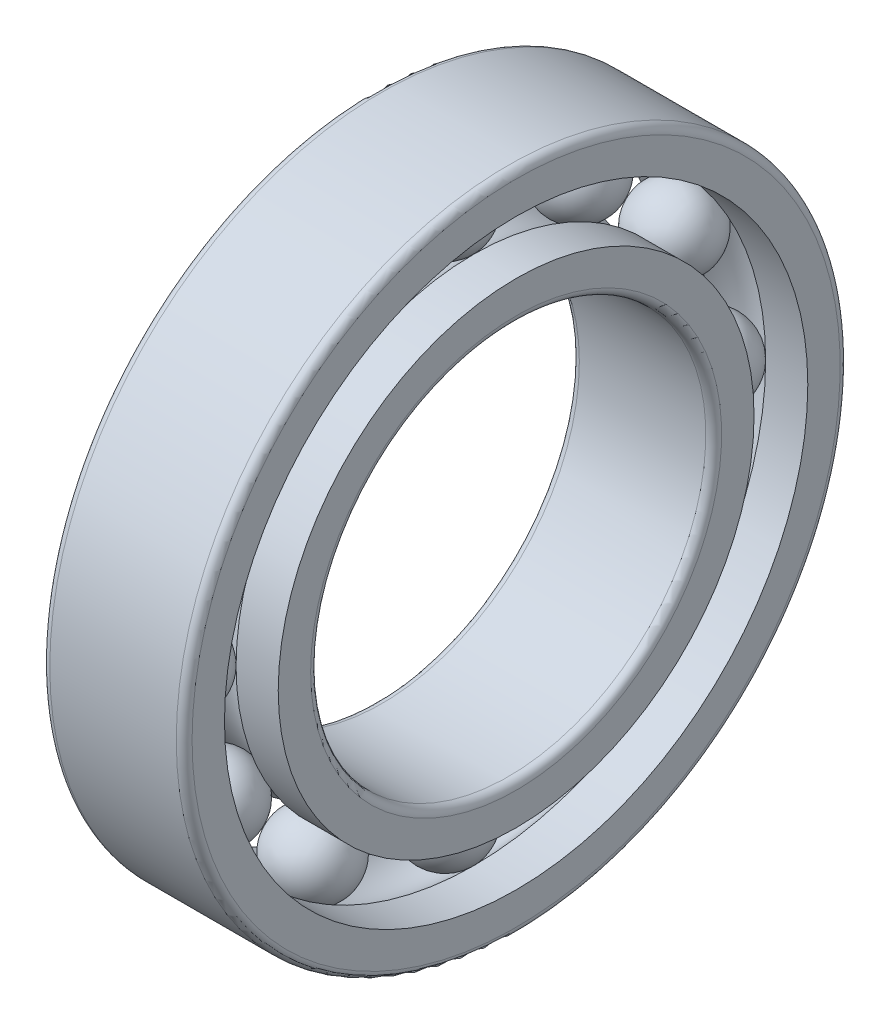
ISO-10303-21;
HEADER;
FILE_DESCRIPTION(('STEP AP214'),'2;1');
FILE_NAME('part.step','',(''),(''),'','','');
FILE_SCHEMA(('AUTOMOTIVE_DESIGN { 1 0 10303 214 1 1 1 1 }'));
ENDSEC;
DATA;
#1=APPLICATION_CONTEXT('core data for automotive mechanical design processes');
#2=APPLICATION_PROTOCOL_DEFINITION('international standard','automotive_design',2000,#1);
#3=PRODUCT_CONTEXT('',#1,'mechanical');
#4=PRODUCT('Part','Part','',(#3));
#5=PRODUCT_RELATED_PRODUCT_CATEGORY('part','',(#4));
#6=PRODUCT_DEFINITION_FORMATION('','',#4);
#7=PRODUCT_DEFINITION_CONTEXT('part definition',#1,'design');
#8=PRODUCT_DEFINITION('design','',#6,#7);
#9=PRODUCT_DEFINITION_SHAPE('','',#8);
#10=(LENGTH_UNIT() NAMED_UNIT(*) SI_UNIT(.MILLI.,.METRE.));
#11=(NAMED_UNIT(*) PLANE_ANGLE_UNIT() SI_UNIT($,.RADIAN.));
#12=(NAMED_UNIT(*) SI_UNIT($,.STERADIAN.) SOLID_ANGLE_UNIT());
#13=UNCERTAINTY_MEASURE_WITH_UNIT(LENGTH_MEASURE(1.E-05),#10,'distance_accuracy_value','');
#14=(GEOMETRIC_REPRESENTATION_CONTEXT(3) GLOBAL_UNCERTAINTY_ASSIGNED_CONTEXT((#13)) GLOBAL_UNIT_ASSIGNED_CONTEXT((#10,
#11,#12)) REPRESENTATION_CONTEXT('',''));
#15=CARTESIAN_POINT('',(0.,0.,0.));
#16=DIRECTION('',(0.,0.,1.));
#17=DIRECTION('',(1.,0.,0.));
#18=AXIS2_PLACEMENT_3D('',#15,#16,#17);
#19=CARTESIAN_POINT('',(4.50000000000001,14.5059255133895,-8.37499999999983));
#20=DIRECTION('',(-1.,0.,0.));
#21=DIRECTION('',(0.,0.866025403784445,-0.499999999999989));
#22=AXIS2_PLACEMENT_3D('',#19,#20,#21);
#23=SPHERICAL_SURFACE('',#22,2.49999999999999);
#24=CARTESIAN_POINT('',(2.00000000000002,14.5059255133895,-8.37499999999983));
#25=VERTEX_POINT('',#24);
#26=VERTEX_LOOP('',#25);
#27=FACE_BOUND('',#26,.T.);
#28=ADVANCED_FACE('F42',(#27),#23,.T.);
#29=CLOSED_SHELL('',(#28));
#30=MANIFOLD_SOLID_BREP('B2',#29);
#31=CARTESIAN_POINT('',(4.50000000000001,8.37500000000018,-14.5059255133893));
#32=DIRECTION('',(-1.,0.,0.));
#33=DIRECTION('',(0.,0.50000000000001,-0.866025403784433));
#34=AXIS2_PLACEMENT_3D('',#31,#32,#33);
#35=SPHERICAL_SURFACE('',#34,2.49999999999999);
#36=CARTESIAN_POINT('',(2.00000000000002,8.37500000000018,-14.5059255133893));
#37=VERTEX_POINT('',#36);
#38=VERTEX_LOOP('',#37);
#39=FACE_BOUND('',#38,.T.);
#40=ADVANCED_FACE('F63',(#39),#35,.T.);
#41=CLOSED_SHELL('',(#40));
#42=MANIFOLD_SOLID_BREP('B6',#41);
#43=CARTESIAN_POINT('',(4.50000000000001,1.75446937276868E-13,-16.75));
#44=DIRECTION('',(-1.,0.,0.));
#45=DIRECTION('',(0.,0.,-1.));
#46=AXIS2_PLACEMENT_3D('',#43,#44,#45);
#47=SPHERICAL_SURFACE('',#46,2.49999999999999);
#48=CARTESIAN_POINT('',(2.00000000000002,1.75446937276868E-13,-16.75));
#49=VERTEX_POINT('',#48);
#50=VERTEX_LOOP('',#49);
#51=FACE_BOUND('',#50,.T.);
#52=ADVANCED_FACE('F84',(#51),#47,.T.);
#53=CLOSED_SHELL('',(#52));
#54=MANIFOLD_SOLID_BREP('B38',#53);
#55=CARTESIAN_POINT('',(4.50000000000001,-8.37499999999988,-14.5059255133894));
#56=DIRECTION('',(-1.,0.,0.));
#57=DIRECTION('',(0.,-0.499999999999992,-0.866025403784443));
#58=AXIS2_PLACEMENT_3D('',#55,#56,#57);
#59=SPHERICAL_SURFACE('',#58,2.49999999999999);
#60=CARTESIAN_POINT('',(2.00000000000002,-8.37499999999988,-14.5059255133894));
#61=VERTEX_POINT('',#60);
#62=VERTEX_LOOP('',#61);
#63=FACE_BOUND('',#62,.T.);
#64=ADVANCED_FACE('F105',(#63),#59,.T.);
#65=CLOSED_SHELL('',(#64));
#66=MANIFOLD_SOLID_BREP('B59',#65);
#67=CARTESIAN_POINT('',(4.50000000000001,-14.5059255133893,-8.37500000000013));
#68=DIRECTION('',(-1.,0.,0.));
#69=DIRECTION('',(0.,-0.866025403784435,-0.500000000000007));
#70=AXIS2_PLACEMENT_3D('',#67,#68,#69);
#71=SPHERICAL_SURFACE('',#70,2.49999999999999);
#72=CARTESIAN_POINT('',(2.00000000000002,-14.5059255133893,-8.37500000000013));
#73=VERTEX_POINT('',#72);
#74=VERTEX_LOOP('',#73);
#75=FACE_BOUND('',#74,.T.);
#76=ADVANCED_FACE('F126',(#75),#71,.T.);
#77=CLOSED_SHELL('',(#76));
#78=MANIFOLD_SOLID_BREP('B80',#77);
#79=CARTESIAN_POINT('',(4.50000000000001,-16.75,0.));
#80=DIRECTION('',(-1.,0.,0.));
#81=DIRECTION('',(0.,-1.,0.));
#82=AXIS2_PLACEMENT_3D('',#79,#80,#81);
#83=SPHERICAL_SURFACE('',#82,2.49999999999999);
#84=CARTESIAN_POINT('',(2.00000000000002,-16.75,0.));
#85=VERTEX_POINT('',#84);
#86=VERTEX_LOOP('',#85);
#87=FACE_BOUND('',#86,.T.);
#88=ADVANCED_FACE('F147',(#87),#83,.T.);
#89=CLOSED_SHELL('',(#88));
#90=MANIFOLD_SOLID_BREP('B101',#89);
#91=CARTESIAN_POINT('',(4.50000000000001,-14.5059255133894,8.37499999999993));
#92=DIRECTION('',(-1.,0.,0.));
#93=DIRECTION('',(0.,-0.866025403784442,0.499999999999995));
#94=AXIS2_PLACEMENT_3D('',#91,#92,#93);
#95=SPHERICAL_SURFACE('',#94,2.49999999999999);
#96=CARTESIAN_POINT('',(2.00000000000002,-14.5059255133894,8.37499999999993));
#97=VERTEX_POINT('',#96);
#98=VERTEX_LOOP('',#97);
#99=FACE_BOUND('',#98,.T.);
#100=ADVANCED_FACE('F168',(#99),#95,.T.);
#101=CLOSED_SHELL('',(#100));
#102=MANIFOLD_SOLID_BREP('B122',#101);
#103=CARTESIAN_POINT('',(4.50000000000001,-8.37500000000008,14.5059255133893));
#104=DIRECTION('',(-1.,0.,0.));
#105=DIRECTION('',(0.,-0.500000000000004,0.866025403784436));
#106=AXIS2_PLACEMENT_3D('',#103,#104,#105);
#107=SPHERICAL_SURFACE('',#106,2.49999999999999);
#108=CARTESIAN_POINT('',(2.00000000000002,-8.37500000000008,14.5059255133893));
#109=VERTEX_POINT('',#108);
#110=VERTEX_LOOP('',#109);
#111=FACE_BOUND('',#110,.T.);
#112=ADVANCED_FACE('F189',(#111),#107,.T.);
#113=CLOSED_SHELL('',(#112));
#114=MANIFOLD_SOLID_BREP('B143',#113);
#115=CARTESIAN_POINT('',(4.50000000000001,0.,16.75));
#116=DIRECTION('',(-1.,0.,0.));
#117=DIRECTION('',(0.,0.,1.));
#118=AXIS2_PLACEMENT_3D('',#115,#116,#117);
#119=SPHERICAL_SURFACE('',#118,2.49999999999999);
#120=CARTESIAN_POINT('',(2.00000000000002,0.,16.75));
#121=VERTEX_POINT('',#120);
#122=VERTEX_LOOP('',#121);
#123=FACE_BOUND('',#122,.T.);
#124=ADVANCED_FACE('F210',(#123),#119,.T.);
#125=CLOSED_SHELL('',(#124));
#126=MANIFOLD_SOLID_BREP('B164',#125);
#127=CARTESIAN_POINT('',(4.50000000000001,8.37499999999998,14.5059255133894));
#128=DIRECTION('',(-1.,0.,0.));
#129=DIRECTION('',(0.,0.499999999999998,0.86602540378444));
#130=AXIS2_PLACEMENT_3D('',#127,#128,#129);
#131=SPHERICAL_SURFACE('',#130,2.49999999999999);
#132=CARTESIAN_POINT('',(2.00000000000002,8.37499999999998,14.5059255133894));
#133=VERTEX_POINT('',#132);
#134=VERTEX_LOOP('',#133);
#135=FACE_BOUND('',#134,.T.);
#136=ADVANCED_FACE('F231',(#135),#131,.T.);
#137=CLOSED_SHELL('',(#136));
#138=MANIFOLD_SOLID_BREP('B185',#137);
#139=CARTESIAN_POINT('',(4.50000000000001,14.5059255133894,8.37500000000003));
#140=DIRECTION('',(-1.,0.,0.));
#141=DIRECTION('',(0.,0.866025403784438,0.500000000000001));
#142=AXIS2_PLACEMENT_3D('',#139,#140,#141);
#143=SPHERICAL_SURFACE('',#142,2.49999999999999);
#144=CARTESIAN_POINT('',(2.00000000000002,14.5059255133894,8.37500000000003));
#145=VERTEX_POINT('',#144);
#146=VERTEX_LOOP('',#145);
#147=FACE_BOUND('',#146,.T.);
#148=ADVANCED_FACE('F252',(#147),#143,.T.);
#149=CLOSED_SHELL('',(#148));
#150=MANIFOLD_SOLID_BREP('B206',#149);
#151=CARTESIAN_POINT('',(4.50000000000001,16.75,0.));
#152=DIRECTION('',(-1.,0.,0.));
#153=DIRECTION('',(0.,1.,0.));
#154=AXIS2_PLACEMENT_3D('',#151,#152,#153);
#155=SPHERICAL_SURFACE('',#154,2.49999999999999);
#156=CARTESIAN_POINT('',(2.00000000000002,16.75,0.));
#157=VERTEX_POINT('',#156);
#158=VERTEX_LOOP('',#157);
#159=FACE_BOUND('',#158,.T.);
#160=ADVANCED_FACE('F275',(#159),#155,.T.);
#161=CLOSED_SHELL('',(#160));
#162=MANIFOLD_SOLID_BREP('B227',#161);
#163=CARTESIAN_POINT('',(0.,0.,0.));
#164=DIRECTION('',(-1.,0.,0.));
#165=DIRECTION('',(0.,0.,1.));
#166=AXIS2_PLACEMENT_3D('',#163,#164,#165);
#167=CYLINDRICAL_SURFACE('',#166,18.45);
#168=CARTESIAN_POINT('',(2.66696972201768,0.,0.));
#169=DIRECTION('',(-1.,0.,0.));
#170=DIRECTION('',(0.,0.,1.));
#171=AXIS2_PLACEMENT_3D('',#168,#169,#170);
#172=CIRCLE('',#171,18.45);
#173=CARTESIAN_POINT('',(2.66696972201768,0.,18.45));
#174=VERTEX_POINT('',#173);
#175=EDGE_CURVE('E326',#174,#174,#172,.T.);
#176=ORIENTED_EDGE('',*,*,#175,.F.);
#177=EDGE_LOOP('',(#176));
#178=FACE_BOUND('',#177,.T.);
#179=CARTESIAN_POINT('',(0.,0.,0.));
#180=DIRECTION('',(-1.,0.,0.));
#181=DIRECTION('',(0.,0.,1.));
#182=AXIS2_PLACEMENT_3D('',#179,#180,#181);
#183=CIRCLE('',#182,18.45);
#184=CARTESIAN_POINT('',(0.,0.,18.45));
#185=VERTEX_POINT('',#184);
#186=EDGE_CURVE('E317',#185,#185,#183,.T.);
#187=ORIENTED_EDGE('',*,*,#186,.T.);
#188=EDGE_LOOP('',(#187));
#189=FACE_BOUND('',#188,.T.);
#190=ADVANCED_FACE('F297',(#178,#189),#167,.F.);
#191=CARTESIAN_POINT('',(0.,21.0000000000008,0.));
#192=DIRECTION('',(1.,0.,0.));
#193=DIRECTION('',(0.,0.,-1.));
#194=AXIS2_PLACEMENT_3D('',#191,#192,#193);
#195=PLANE('',#194);
#196=CARTESIAN_POINT('',(0.,0.,0.));
#197=DIRECTION('',(1.,0.,0.));
#198=DIRECTION('',(0.,0.,-1.));
#199=AXIS2_PLACEMENT_3D('',#196,#197,#198);
#200=CIRCLE('',#199,20.5000000000004);
#201=CARTESIAN_POINT('',(0.,0.,-20.5000000000004));
#202=VERTEX_POINT('',#201);
#203=EDGE_CURVE('E274',#202,#202,#200,.F.);
#204=ORIENTED_EDGE('',*,*,#203,.T.);
#205=EDGE_LOOP('',(#204));
#206=FACE_BOUND('',#205,.T.);
#207=ORIENTED_EDGE('',*,*,#186,.F.);
#208=EDGE_LOOP('',(#207));
#209=FACE_BOUND('',#208,.T.);
#210=ADVANCED_FACE('F335',(#206,#209),#195,.F.);
#211=CARTESIAN_POINT('',(0.,0.,0.));
#212=DIRECTION('',(-1.,0.,0.));
#213=DIRECTION('',(0.,0.,1.));
#214=AXIS2_PLACEMENT_3D('',#211,#212,#213);
#215=CYLINDRICAL_SURFACE('',#214,21.0000000000004);
#216=CARTESIAN_POINT('',(8.5,0.,0.));
#217=DIRECTION('',(-1.,0.,0.));
#218=DIRECTION('',(0.,0.,1.));
#219=AXIS2_PLACEMENT_3D('',#216,#217,#218);
#220=CIRCLE('',#219,21.0000000000004);
#221=CARTESIAN_POINT('',(8.5,0.,21.0000000000004));
#222=VERTEX_POINT('',#221);
#223=EDGE_CURVE('E308',#222,#222,#220,.T.);
#224=ORIENTED_EDGE('',*,*,#223,.T.);
#225=EDGE_LOOP('',(#224));
#226=FACE_BOUND('',#225,.T.);
#227=CARTESIAN_POINT('',(0.5,0.,0.));
#228=DIRECTION('',(1.,0.,0.));
#229=DIRECTION('',(0.,0.,-1.));
#230=AXIS2_PLACEMENT_3D('',#227,#228,#229);
#231=CIRCLE('',#230,21.0000000000004);
#232=CARTESIAN_POINT('',(0.5,0.,-21.0000000000004));
#233=VERTEX_POINT('',#232);
#234=EDGE_CURVE('E312',#233,#233,#231,.T.);
#235=ORIENTED_EDGE('',*,*,#234,.T.);
#236=EDGE_LOOP('',(#235));
#237=FACE_BOUND('',#236,.T.);
#238=ADVANCED_FACE('F340',(#226,#237),#215,.T.);
#239=CARTESIAN_POINT('',(9.,18.45,0.));
#240=DIRECTION('',(-1.,0.,0.));
#241=DIRECTION('',(0.,0.,1.));
#242=AXIS2_PLACEMENT_3D('',#239,#240,#241);
#243=PLANE('',#242);
#244=CARTESIAN_POINT('',(9.,0.,0.));
#245=DIRECTION('',(-1.,0.,0.));
#246=DIRECTION('',(0.,0.,1.));
#247=AXIS2_PLACEMENT_3D('',#244,#245,#246);
#248=CIRCLE('',#247,20.5000000000004);
#249=CARTESIAN_POINT('',(9.,0.,20.5000000000004));
#250=VERTEX_POINT('',#249);
#251=EDGE_CURVE('E304',#250,#250,#248,.F.);
#252=ORIENTED_EDGE('',*,*,#251,.T.);
#253=EDGE_LOOP('',(#252));
#254=FACE_BOUND('',#253,.T.);
#255=CARTESIAN_POINT('',(9.,0.,0.));
#256=DIRECTION('',(-1.,0.,0.));
#257=DIRECTION('',(0.,0.,1.));
#258=AXIS2_PLACEMENT_3D('',#255,#256,#257);
#259=CIRCLE('',#258,18.45);
#260=CARTESIAN_POINT('',(9.,0.,18.45));
#261=VERTEX_POINT('',#260);
#262=EDGE_CURVE('E320',#261,#261,#259,.T.);
#263=ORIENTED_EDGE('',*,*,#262,.T.);
#264=EDGE_LOOP('',(#263));
#265=FACE_BOUND('',#264,.T.);
#266=ADVANCED_FACE('F345',(#254,#265),#243,.F.);
#267=CARTESIAN_POINT('',(0.,0.,0.));
#268=DIRECTION('',(-1.,0.,0.));
#269=DIRECTION('',(0.,0.,1.));
#270=AXIS2_PLACEMENT_3D('',#267,#268,#269);
#271=CYLINDRICAL_SURFACE('',#270,18.45);
#272=ORIENTED_EDGE('',*,*,#262,.F.);
#273=EDGE_LOOP('',(#272));
#274=FACE_BOUND('',#273,.T.);
#275=CARTESIAN_POINT('',(6.33303027798233,0.,0.));
#276=DIRECTION('',(-1.,0.,0.));
#277=DIRECTION('',(0.,0.,1.));
#278=AXIS2_PLACEMENT_3D('',#275,#276,#277);
#279=CIRCLE('',#278,18.45);
#280=CARTESIAN_POINT('',(6.33303027798233,0.,18.45));
#281=VERTEX_POINT('',#280);
#282=EDGE_CURVE('E323',#281,#281,#279,.T.);
#283=ORIENTED_EDGE('',*,*,#282,.T.);
#284=EDGE_LOOP('',(#283));
#285=FACE_BOUND('',#284,.T.);
#286=ADVANCED_FACE('F357',(#274,#285),#271,.F.);
#287=CARTESIAN_POINT('',(4.5,0.,0.));
#288=DIRECTION('',(-1.,0.,0.));
#289=DIRECTION('',(0.,0.,1.));
#290=AXIS2_PLACEMENT_3D('',#287,#288,#289);
#291=TOROIDAL_SURFACE('',#290,16.75,2.50000000000002);
#292=ORIENTED_EDGE('',*,*,#175,.T.);
#293=EDGE_LOOP('',(#292));
#294=FACE_BOUND('',#293,.T.);
#295=ORIENTED_EDGE('',*,*,#282,.F.);
#296=EDGE_LOOP('',(#295));
#297=FACE_BOUND('',#296,.T.);
#298=ADVANCED_FACE('F330',(#294,#297),#291,.F.);
#299=CARTESIAN_POINT('',(8.5,0.,0.));
#300=DIRECTION('',(-1.,0.,0.));
#301=DIRECTION('',(0.,0.,1.));
#302=AXIS2_PLACEMENT_3D('',#299,#300,#301);
#303=TOROIDAL_SURFACE('',#302,20.5000000000004,0.5);
#304=ORIENTED_EDGE('',*,*,#251,.F.);
#305=EDGE_LOOP('',(#304));
#306=FACE_BOUND('',#305,.T.);
#307=ORIENTED_EDGE('',*,*,#223,.F.);
#308=EDGE_LOOP('',(#307));
#309=FACE_BOUND('',#308,.T.);
#310=ADVANCED_FACE('F349',(#306,#309),#303,.T.);
#311=CARTESIAN_POINT('',(0.5,0.,0.));
#312=DIRECTION('',(1.,0.,0.));
#313=DIRECTION('',(0.,0.,-1.));
#314=AXIS2_PLACEMENT_3D('',#311,#312,#313);
#315=TOROIDAL_SURFACE('',#314,20.5000000000004,0.5);
#316=ORIENTED_EDGE('',*,*,#234,.F.);
#317=EDGE_LOOP('',(#316));
#318=FACE_BOUND('',#317,.T.);
#319=ORIENTED_EDGE('',*,*,#203,.F.);
#320=EDGE_LOOP('',(#319));
#321=FACE_BOUND('',#320,.T.);
#322=ADVANCED_FACE('F299',(#318,#321),#315,.T.);
#323=CLOSED_SHELL('',(#190,#210,#238,#266,#286,#298,#310,#322));
#324=MANIFOLD_SOLID_BREP('B248',#323);
#325=CARTESIAN_POINT('',(0.,0.,0.));
#326=DIRECTION('',(-1.,0.,0.));
#327=DIRECTION('',(0.,0.,1.));
#328=AXIS2_PLACEMENT_3D('',#325,#326,#327);
#329=CYLINDRICAL_SURFACE('',#328,15.05);
#330=CARTESIAN_POINT('',(0.,0.,0.));
#331=DIRECTION('',(-1.,0.,0.));
#332=DIRECTION('',(0.,0.,1.));
#333=AXIS2_PLACEMENT_3D('',#330,#331,#332);
#334=CIRCLE('',#333,15.05);
#335=CARTESIAN_POINT('',(0.,0.,15.05));
#336=VERTEX_POINT('',#335);
#337=EDGE_CURVE('E441',#336,#336,#334,.T.);
#338=ORIENTED_EDGE('',*,*,#337,.F.);
#339=EDGE_LOOP('',(#338));
#340=FACE_BOUND('',#339,.T.);
#341=CARTESIAN_POINT('',(2.66696972201767,0.,0.));
#342=DIRECTION('',(-1.,0.,0.));
#343=DIRECTION('',(0.,0.,1.));
#344=AXIS2_PLACEMENT_3D('',#341,#342,#343);
#345=CIRCLE('',#344,15.0500000000001);
#346=CARTESIAN_POINT('',(2.66696972201767,0.,15.0500000000001));
#347=VERTEX_POINT('',#346);
#348=EDGE_CURVE('E450',#347,#347,#345,.T.);
#349=ORIENTED_EDGE('',*,*,#348,.T.);
#350=EDGE_LOOP('',(#349));
#351=FACE_BOUND('',#350,.T.);
#352=ADVANCED_FACE('F421',(#340,#351),#329,.T.);
#353=CARTESIAN_POINT('',(0.,15.05,0.));
#354=DIRECTION('',(1.,0.,0.));
#355=DIRECTION('',(0.,0.,-1.));
#356=AXIS2_PLACEMENT_3D('',#353,#354,#355);
#357=PLANE('',#356);
#358=CARTESIAN_POINT('',(0.,0.,0.));
#359=DIRECTION('',(1.,0.,0.));
#360=DIRECTION('',(0.,0.,-1.));
#361=AXIS2_PLACEMENT_3D('',#358,#359,#360);
#362=CIRCLE('',#361,13.);
#363=CARTESIAN_POINT('',(0.,0.,-13.));
#364=VERTEX_POINT('',#363);
#365=EDGE_CURVE('E296',#364,#364,#362,.T.);
#366=ORIENTED_EDGE('',*,*,#365,.T.);
#367=EDGE_LOOP('',(#366));
#368=FACE_BOUND('',#367,.T.);
#369=ORIENTED_EDGE('',*,*,#337,.T.);
#370=EDGE_LOOP('',(#369));
#371=FACE_BOUND('',#370,.T.);
#372=ADVANCED_FACE('F470',(#368,#371),#357,.F.);
#373=CARTESIAN_POINT('',(0.,0.,0.));
#374=DIRECTION('',(-1.,0.,0.));
#375=DIRECTION('',(0.,0.,1.));
#376=AXIS2_PLACEMENT_3D('',#373,#374,#375);
#377=CYLINDRICAL_SURFACE('',#376,12.5);
#378=CARTESIAN_POINT('',(8.5,0.,0.));
#379=DIRECTION('',(-1.,0.,0.));
#380=DIRECTION('',(0.,0.,1.));
#381=AXIS2_PLACEMENT_3D('',#378,#379,#380);
#382=CIRCLE('',#381,12.5);
#383=CARTESIAN_POINT('',(8.5,0.,12.5));
#384=VERTEX_POINT('',#383);
#385=EDGE_CURVE('E428',#384,#384,#382,.F.);
#386=ORIENTED_EDGE('',*,*,#385,.T.);
#387=EDGE_LOOP('',(#386));
#388=FACE_BOUND('',#387,.T.);
#389=CARTESIAN_POINT('',(0.5,0.,0.));
#390=DIRECTION('',(1.,0.,0.));
#391=DIRECTION('',(0.,0.,-1.));
#392=AXIS2_PLACEMENT_3D('',#389,#390,#391);
#393=CIRCLE('',#392,12.5);
#394=CARTESIAN_POINT('',(0.5,0.,-12.5));
#395=VERTEX_POINT('',#394);
#396=EDGE_CURVE('E432',#395,#395,#393,.F.);
#397=ORIENTED_EDGE('',*,*,#396,.T.);
#398=EDGE_LOOP('',(#397));
#399=FACE_BOUND('',#398,.T.);
#400=ADVANCED_FACE('F476',(#388,#399),#377,.F.);
#401=CARTESIAN_POINT('',(9.,12.5000000000001,0.));
#402=DIRECTION('',(-1.,0.,0.));
#403=DIRECTION('',(0.,0.,1.));
#404=AXIS2_PLACEMENT_3D('',#401,#402,#403);
#405=PLANE('',#404);
#406=CARTESIAN_POINT('',(9.,0.,0.));
#407=DIRECTION('',(-1.,0.,0.));
#408=DIRECTION('',(0.,0.,1.));
#409=AXIS2_PLACEMENT_3D('',#406,#407,#408);
#410=CIRCLE('',#409,13.);
#411=CARTESIAN_POINT('',(9.,0.,13.));
#412=VERTEX_POINT('',#411);
#413=EDGE_CURVE('E436',#412,#412,#410,.T.);
#414=ORIENTED_EDGE('',*,*,#413,.T.);
#415=EDGE_LOOP('',(#414));
#416=FACE_BOUND('',#415,.T.);
#417=CARTESIAN_POINT('',(9.,0.,0.));
#418=DIRECTION('',(-1.,0.,0.));
#419=DIRECTION('',(0.,0.,1.));
#420=AXIS2_PLACEMENT_3D('',#417,#418,#419);
#421=CIRCLE('',#420,15.0500000000001);
#422=CARTESIAN_POINT('',(9.,0.,15.0500000000001));
#423=VERTEX_POINT('',#422);
#424=EDGE_CURVE('E444',#423,#423,#421,.T.);
#425=ORIENTED_EDGE('',*,*,#424,.F.);
#426=EDGE_LOOP('',(#425));
#427=FACE_BOUND('',#426,.T.);
#428=ADVANCED_FACE('F466',(#416,#427),#405,.F.);
#429=CARTESIAN_POINT('',(0.,0.,0.));
#430=DIRECTION('',(-1.,0.,0.));
#431=DIRECTION('',(0.,0.,1.));
#432=AXIS2_PLACEMENT_3D('',#429,#430,#431);
#433=CYLINDRICAL_SURFACE('',#432,15.0500000000001);
#434=CARTESIAN_POINT('',(6.33303027798233,0.,0.));
#435=DIRECTION('',(-1.,0.,0.));
#436=DIRECTION('',(0.,0.,1.));
#437=AXIS2_PLACEMENT_3D('',#434,#435,#436);
#438=CIRCLE('',#437,15.0500000000001);
#439=CARTESIAN_POINT('',(6.33303027798233,0.,15.0500000000001));
#440=VERTEX_POINT('',#439);
#441=EDGE_CURVE('E447',#440,#440,#438,.T.);
#442=ORIENTED_EDGE('',*,*,#441,.F.);
#443=EDGE_LOOP('',(#442));
#444=FACE_BOUND('',#443,.T.);
#445=ORIENTED_EDGE('',*,*,#424,.T.);
#446=EDGE_LOOP('',(#445));
#447=FACE_BOUND('',#446,.T.);
#448=ADVANCED_FACE('F458',(#444,#447),#433,.T.);
#449=CARTESIAN_POINT('',(4.5,0.,0.));
#450=DIRECTION('',(-1.,0.,0.));
#451=DIRECTION('',(0.,0.,1.));
#452=AXIS2_PLACEMENT_3D('',#449,#450,#451);
#453=TOROIDAL_SURFACE('',#452,16.75,2.49999999999996);
#454=ORIENTED_EDGE('',*,*,#441,.T.);
#455=EDGE_LOOP('',(#454));
#456=FACE_BOUND('',#455,.T.);
#457=ORIENTED_EDGE('',*,*,#348,.F.);
#458=EDGE_LOOP('',(#457));
#459=FACE_BOUND('',#458,.T.);
#460=ADVANCED_FACE('F455',(#456,#459),#453,.F.);
#461=CARTESIAN_POINT('',(8.5,0.,0.));
#462=DIRECTION('',(-1.,0.,0.));
#463=DIRECTION('',(0.,0.,1.));
#464=AXIS2_PLACEMENT_3D('',#461,#462,#463);
#465=TOROIDAL_SURFACE('',#464,13.,0.5);
#466=ORIENTED_EDGE('',*,*,#385,.F.);
#467=EDGE_LOOP('',(#466));
#468=FACE_BOUND('',#467,.T.);
#469=ORIENTED_EDGE('',*,*,#413,.F.);
#470=EDGE_LOOP('',(#469));
#471=FACE_BOUND('',#470,.T.);
#472=ADVANCED_FACE('F457',(#468,#471),#465,.T.);
#473=CARTESIAN_POINT('',(0.5,0.,0.));
#474=DIRECTION('',(1.,0.,0.));
#475=DIRECTION('',(0.,0.,-1.));
#476=AXIS2_PLACEMENT_3D('',#473,#474,#475);
#477=TOROIDAL_SURFACE('',#476,13.,0.5);
#478=ORIENTED_EDGE('',*,*,#365,.F.);
#479=EDGE_LOOP('',(#478));
#480=FACE_BOUND('',#479,.T.);
#481=ORIENTED_EDGE('',*,*,#396,.F.);
#482=EDGE_LOOP('',(#481));
#483=FACE_BOUND('',#482,.T.);
#484=ADVANCED_FACE('F423',(#480,#483),#477,.T.);
#485=CLOSED_SHELL('',(#352,#372,#400,#428,#448,#460,#472,#484));
#486=MANIFOLD_SOLID_BREP('B269',#485);
#487=ADVANCED_BREP_SHAPE_REPRESENTATION('',(#18,#30,#42,#54,#66,#78,#90,#102,#114,#126,#138,
#150,#162,#324,#486),#14);
#488=SHAPE_DEFINITION_REPRESENTATION(#9,#487);
ENDSEC;
END-ISO-10303-21;
